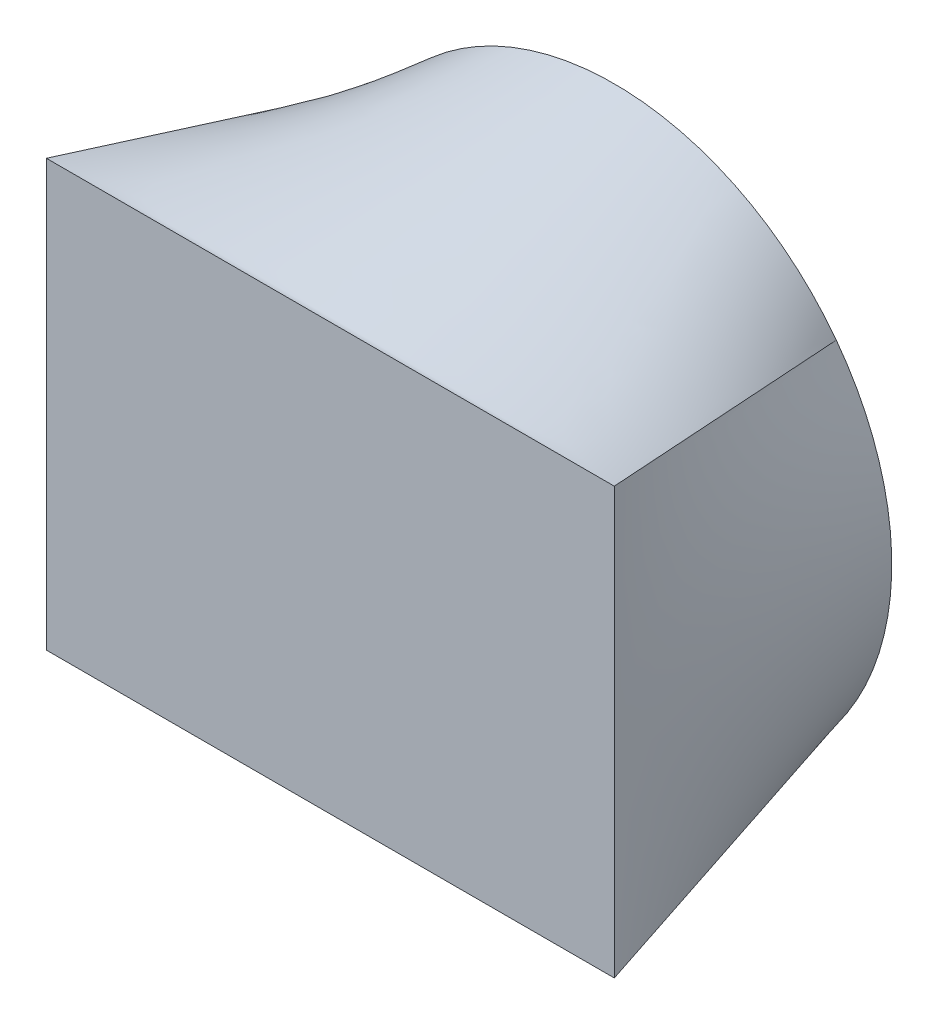
ISO-10303-21;
HEADER;
FILE_DESCRIPTION(('STEP AP214'),'2;1');
FILE_NAME('part.step','',(''),(''),'','','');
FILE_SCHEMA(('AUTOMOTIVE_DESIGN { 1 0 10303 214 1 1 1 1 }'));
ENDSEC;
DATA;
#1=APPLICATION_CONTEXT('core data for automotive mechanical design processes');
#2=APPLICATION_PROTOCOL_DEFINITION('international standard','automotive_design',2000,#1);
#3=PRODUCT_CONTEXT('',#1,'mechanical');
#4=PRODUCT('Part','Part','',(#3));
#5=PRODUCT_RELATED_PRODUCT_CATEGORY('part','',(#4));
#6=PRODUCT_DEFINITION_FORMATION('','',#4);
#7=PRODUCT_DEFINITION_CONTEXT('part definition',#1,'design');
#8=PRODUCT_DEFINITION('design','',#6,#7);
#9=PRODUCT_DEFINITION_SHAPE('','',#8);
#10=(LENGTH_UNIT() NAMED_UNIT(*) SI_UNIT(.MILLI.,.METRE.));
#11=(NAMED_UNIT(*) PLANE_ANGLE_UNIT() SI_UNIT($,.RADIAN.));
#12=(NAMED_UNIT(*) SI_UNIT($,.STERADIAN.) SOLID_ANGLE_UNIT());
#13=UNCERTAINTY_MEASURE_WITH_UNIT(LENGTH_MEASURE(1.E-05),#10,'distance_accuracy_value','');
#14=(GEOMETRIC_REPRESENTATION_CONTEXT(3) GLOBAL_UNCERTAINTY_ASSIGNED_CONTEXT((#13)) GLOBAL_UNIT_ASSIGNED_CONTEXT((#10,
#11,#12)) REPRESENTATION_CONTEXT('',''));
#15=CARTESIAN_POINT('',(0.,0.,0.));
#16=DIRECTION('',(0.,0.,1.));
#17=DIRECTION('',(1.,0.,0.));
#18=AXIS2_PLACEMENT_3D('',#15,#16,#17);
#19=CARTESIAN_POINT('',(50.,37.5,-50.));
#20=DIRECTION('',(0.,0.,1.));
#21=DIRECTION('',(1.,0.,0.));
#22=AXIS2_PLACEMENT_3D('',#19,#20,#21);
#23=PLANE('',#22);
#24=CARTESIAN_POINT('',(50.,37.5,-50.));
#25=DIRECTION('',(0.,0.,1.));
#26=DIRECTION('',(1.,0.,0.));
#27=AXIS2_PLACEMENT_3D('',#24,#25,#26);
#28=CIRCLE('',#27,48.860251190292);
#29=CARTESIAN_POINT('',(10.9117990477664,66.8161507141752,-50.));
#30=VERTEX_POINT('',#29);
#31=CARTESIAN_POINT('',(10.9117990477664,8.18384928582481,-50.));
#32=VERTEX_POINT('',#31);
#33=EDGE_CURVE('E100',#30,#32,#28,.T.);
#34=ORIENTED_EDGE('',*,*,#33,.F.);
#35=CARTESIAN_POINT('',(89.0882009522336,66.8161507141752,-50.));
#36=VERTEX_POINT('',#35);
#37=EDGE_CURVE('E155',#36,#30,#28,.T.);
#38=ORIENTED_EDGE('',*,*,#37,.F.);
#39=CARTESIAN_POINT('',(89.0882009522336,8.18384928582479,-50.));
#40=VERTEX_POINT('',#39);
#41=EDGE_CURVE('E128',#40,#36,#28,.T.);
#42=ORIENTED_EDGE('',*,*,#41,.F.);
#43=EDGE_CURVE('E110',#32,#40,#28,.T.);
#44=ORIENTED_EDGE('',*,*,#43,.F.);
#45=EDGE_LOOP('',(#34,#38,#42,#44));
#46=FACE_BOUND('',#45,.T.);
#47=ADVANCED_FACE('F61',(#46),#23,.F.);
#48=CARTESIAN_POINT('',(0.,75.,0.));
#49=DIRECTION('',(0.,0.,-1.));
#50=DIRECTION('',(-1.,0.,0.));
#51=AXIS2_PLACEMENT_3D('',#48,#49,#50);
#52=PLANE('',#51);
#53=DIRECTION('',(0.,-1.,0.));
#54=VECTOR('',#53,1.);
#55=CARTESIAN_POINT('',(0.,0.,0.));
#56=LINE('',#55,#54);
#57=CARTESIAN_POINT('',(0.,75.,0.));
#58=VERTEX_POINT('',#57);
#59=CARTESIAN_POINT('',(0.,0.,0.));
#60=VERTEX_POINT('',#59);
#61=EDGE_CURVE('E205',#58,#60,#56,.T.);
#62=ORIENTED_EDGE('',*,*,#61,.T.);
#63=DIRECTION('',(1.,0.,0.));
#64=VECTOR('',#63,1.);
#65=CARTESIAN_POINT('',(0.,0.,0.));
#66=LINE('',#65,#64);
#67=CARTESIAN_POINT('',(100.,0.,0.));
#68=VERTEX_POINT('',#67);
#69=EDGE_CURVE('E12',#60,#68,#66,.T.);
#70=ORIENTED_EDGE('',*,*,#69,.T.);
#71=DIRECTION('',(0.,1.,0.));
#72=VECTOR('',#71,1.);
#73=CARTESIAN_POINT('',(100.,0.,0.));
#74=LINE('',#73,#72);
#75=CARTESIAN_POINT('',(100.,75.,0.));
#76=VERTEX_POINT('',#75);
#77=EDGE_CURVE('E72',#68,#76,#74,.T.);
#78=ORIENTED_EDGE('',*,*,#77,.T.);
#79=DIRECTION('',(-1.,0.,0.));
#80=VECTOR('',#79,1.);
#81=CARTESIAN_POINT('',(0.,75.,0.));
#82=LINE('',#81,#80);
#83=EDGE_CURVE('E81',#76,#58,#82,.T.);
#84=ORIENTED_EDGE('',*,*,#83,.T.);
#85=EDGE_LOOP('',(#62,#70,#78,#84));
#86=FACE_BOUND('',#85,.T.);
#87=ADVANCED_FACE('F170',(#86),#52,.F.);
#88=CARTESIAN_POINT('',(0.,0.,0.));
#89=CARTESIAN_POINT('',(10.9117990477664,8.18384928582481,-50.));
#90=CARTESIAN_POINT('',(0.,3.125,0.));
#91=CARTESIAN_POINT('',(9.44599151205763,10.1382593334365,-50.));
#92=CARTESIAN_POINT('',(0.,6.24999999999999,0.));
#93=CARTESIAN_POINT('',(8.0902651266661,12.2527191081306,-50.));
#94=CARTESIAN_POINT('',(0.,12.5,0.));
#95=CARTESIAN_POINT('',(5.6857621845833,16.7611621245358,-50.));
#96=CARTESIAN_POINT('',(0.,15.625,0.));
#97=CARTESIAN_POINT('',(4.63741470937828,19.155099260913,-50.));
#98=CARTESIAN_POINT('',(0.,21.875,0.));
#99=CARTESIAN_POINT('',(2.92427222790712,24.1517648318706,-50.));
#100=CARTESIAN_POINT('',(0.,25.,0.));
#101=CARTESIAN_POINT('',(2.25987442558057,26.754230606235,-50.));
#102=CARTESIAN_POINT('',(0.,31.25,0.));
#103=CARTESIAN_POINT('',(1.36749219218832,32.0713414135305,-50.));
#104=CARTESIAN_POINT('',(0.,34.375,0.));
#105=CARTESIAN_POINT('',(1.139748809708,34.7855416005394,-50.));
#106=CARTESIAN_POINT('',(0.,40.625,0.));
#107=CARTESIAN_POINT('',(1.139748809708,40.2144583994607,-50.));
#108=CARTESIAN_POINT('',(0.,43.75,0.));
#109=CARTESIAN_POINT('',(1.36749219218832,42.9286585864696,-50.));
#110=CARTESIAN_POINT('',(0.,50.,0.));
#111=CARTESIAN_POINT('',(2.25987442558057,48.2457693937651,-50.));
#112=CARTESIAN_POINT('',(0.,53.125,0.));
#113=CARTESIAN_POINT('',(2.92427222790713,50.8482351681295,-50.));
#114=CARTESIAN_POINT('',(0.,59.375,0.));
#115=CARTESIAN_POINT('',(4.63741470937829,55.844900739087,-50.));
#116=CARTESIAN_POINT('',(0.,62.5,0.));
#117=CARTESIAN_POINT('',(5.68576218458331,58.2388378754642,-50.));
#118=CARTESIAN_POINT('',(0.,68.75,0.));
#119=CARTESIAN_POINT('',(8.09026512666611,62.7472808918695,-50.));
#120=CARTESIAN_POINT('',(0.,71.875,0.));
#121=CARTESIAN_POINT('',(9.44599151205764,64.8617406665635,-50.));
#122=CARTESIAN_POINT('',(0.,75.,0.));
#123=CARTESIAN_POINT('',(10.9117990477664,66.8161507141752,-50.));
#124=B_SPLINE_SURFACE_WITH_KNOTS('',3,1,((#88,#89),(#90,#91),(#92,#93),(#94,#95),(#96,#97),(#98,
#99),(#100,#101),(#102,#103),(#104,#105),(#106,#107),(#108,#109),(#110,#111),(#112,#113),(#114,
#115),(#116,#117),(#118,#119),(#120,#121),(#122,#123)),.UNSPECIFIED.,.F.,.F.,.F.,(4,2,2,2,2,2,2,
2,4),(2,2),(0.,0.125,0.25,0.375,0.5,0.625,0.75,0.875,1.),(0.,1.),.UNSPECIFIED.);
#125=DIRECTION('',(0.210542560059835,-0.157906920044876,-0.964747238920844));
#126=VECTOR('',#125,1.);
#127=CARTESIAN_POINT('',(5.4558995238832,70.9080753570876,-25.));
#128=LINE('',#127,#126);
#129=EDGE_CURVE('E115',#58,#30,#128,.T.);
#130=DIRECTION('',(-0.210542560059834,-0.157906920044876,0.964747238920844));
#131=VECTOR('',#130,1.);
#132=CARTESIAN_POINT('',(5.4558995238832,4.0919246429124,-25.));
#133=LINE('',#132,#131);
#134=EDGE_CURVE('E107',#32,#60,#133,.T.);
#135=ORIENTED_EDGE('',*,*,#61,.F.);
#136=ORIENTED_EDGE('',*,*,#129,.T.);
#137=ORIENTED_EDGE('',*,*,#33,.T.);
#138=ORIENTED_EDGE('',*,*,#134,.T.);
#139=EDGE_LOOP('',(#135,#136,#137,#138));
#140=FACE_BOUND('',#139,.T.);
#141=ADVANCED_FACE('F120',(#140),#124,.T.);
#142=CARTESIAN_POINT('',(0.,75.,0.));
#143=CARTESIAN_POINT('',(10.9117990477664,66.8161507141752,-50.));
#144=CARTESIAN_POINT('',(4.16666666666667,75.,0.));
#145=CARTESIAN_POINT('',(12.8662090953781,69.4220307776574,-50.));
#146=CARTESIAN_POINT('',(8.33333333333334,75.,0.));
#147=CARTESIAN_POINT('',(15.1832125126786,71.9653188636344,-50.));
#148=CARTESIAN_POINT('',(14.5833333333334,75.,0.));
#149=CARTESIAN_POINT('',(19.2174610628247,75.4861175983074,-50.));
#150=CARTESIAN_POINT('',(16.6666666666667,75.,0.));
#151=CARTESIAN_POINT('',(20.6545186554323,76.6101886118667,-50.));
#152=CARTESIAN_POINT('',(20.8333333333334,75.,0.));
#153=CARTESIAN_POINT('',(23.7039141527761,78.7223240212823,-50.));
#154=CARTESIAN_POINT('',(22.9166666666667,75.,0.));
#155=CARTESIAN_POINT('',(25.3162744851812,79.7102977410942,-50.));
#156=CARTESIAN_POINT('',(27.0833333333334,75.,0.));
#157=CARTESIAN_POINT('',(28.6976067474852,81.5136749476564,-50.));
#158=CARTESIAN_POINT('',(29.1666666666667,75.,0.));
#159=CARTESIAN_POINT('',(30.4665679541894,82.3289760689456,-50.));
#160=CARTESIAN_POINT('',(33.3333333333334,75.,0.));
#161=CARTESIAN_POINT('',(34.1327972211462,83.7539072820138,-50.));
#162=CARTESIAN_POINT('',(35.4166666666667,75.,0.));
#163=CARTESIAN_POINT('',(36.0300157543496,84.3634377688663,-50.));
#164=CARTESIAN_POINT('',(39.5833333333334,75.,0.));
#165=CARTESIAN_POINT('',(39.9157067365835,85.3502799230844,-50.));
#166=CARTESIAN_POINT('',(41.6666666666667,75.,0.));
#167=CARTESIAN_POINT('',(41.9040925823774,85.7275118374162,-50.));
#168=CARTESIAN_POINT('',(45.8333333333334,75.,0.));
#169=CARTESIAN_POINT('',(45.9283740472775,86.2325197075213,-50.));
#170=CARTESIAN_POINT('',(47.9166666666667,75.,0.));
#171=CARTESIAN_POINT('',(47.9641562004045,86.360251190292,-50.));
#172=CARTESIAN_POINT('',(52.0833333333333,75.,0.));
#173=CARTESIAN_POINT('',(52.0358437995955,86.360251190292,-50.));
#174=CARTESIAN_POINT('',(54.1666666666667,75.,0.));
#175=CARTESIAN_POINT('',(54.0716259527225,86.2325197075213,-50.));
#176=CARTESIAN_POINT('',(58.3333333333334,75.,0.));
#177=CARTESIAN_POINT('',(58.0959074176226,85.7275118374162,-50.));
#178=CARTESIAN_POINT('',(60.4166666666667,75.,0.));
#179=CARTESIAN_POINT('',(60.0842932634165,85.3502799230844,-50.));
#180=CARTESIAN_POINT('',(64.5833333333334,75.,0.));
#181=CARTESIAN_POINT('',(63.9699842456504,84.3634377688662,-50.));
#182=CARTESIAN_POINT('',(66.6666666666667,75.,0.));
#183=CARTESIAN_POINT('',(65.8672027788537,83.7539072820138,-50.));
#184=CARTESIAN_POINT('',(70.8333333333334,75.,0.));
#185=CARTESIAN_POINT('',(69.5334320458106,82.3289760689456,-50.));
#186=CARTESIAN_POINT('',(72.9166666666667,75.,0.));
#187=CARTESIAN_POINT('',(71.3023932525149,81.5136749476564,-50.));
#188=CARTESIAN_POINT('',(77.0833333333334,75.,0.));
#189=CARTESIAN_POINT('',(74.6837255148188,79.7102977410943,-50.));
#190=CARTESIAN_POINT('',(79.1666666666667,75.,0.));
#191=CARTESIAN_POINT('',(76.296085847224,78.7223240212823,-50.));
#192=CARTESIAN_POINT('',(83.3333333333333,75.,0.));
#193=CARTESIAN_POINT('',(79.3454813445677,76.6101886118668,-50.));
#194=CARTESIAN_POINT('',(85.4166666666667,75.,0.));
#195=CARTESIAN_POINT('',(80.7825389371753,75.4861175983074,-50.));
#196=CARTESIAN_POINT('',(91.6666666666666,75.,0.));
#197=CARTESIAN_POINT('',(84.8167874873214,71.9653188636344,-50.));
#198=CARTESIAN_POINT('',(95.8333333333333,75.,0.));
#199=CARTESIAN_POINT('',(87.1337909046219,69.4220307776575,-50.));
#200=CARTESIAN_POINT('',(100.,75.,0.));
#201=CARTESIAN_POINT('',(89.0882009522336,66.8161507141752,-50.));
#202=B_SPLINE_SURFACE_WITH_KNOTS('',3,1,((#142,#143),(#144,#145),(#146,#147),(#148,#149),(#150,
#151),(#152,#153),(#154,#155),(#156,#157),(#158,#159),(#160,#161),(#162,#163),(#164,#165),(#166,
#167),(#168,#169),(#170,#171),(#172,#173),(#174,#175),(#176,#177),(#178,#179),(#180,#181),(#182,
#183),(#184,#185),(#186,#187),(#188,#189),(#190,#191),(#192,#193),(#194,#195),(#196,#197),(#198,
#199),(#200,#201)),.UNSPECIFIED.,.F.,.F.,.F.,(4,2,2,2,2,2,2,2,2,2,2,2,2,2,4),(2,2),(0.,0.125,
0.1875,0.250000000000001,0.312500000000001,0.375000000000001,0.437500000000001,0.5,
0.562500000000001,0.625000000000001,0.687500000000001,0.75,0.8125,0.875,1.),(0.,1.),.UNSPECIFIED.);
#203=DIRECTION('',(-0.210542560059835,-0.157906920044876,-0.964747238920844));
#204=VECTOR('',#203,1.);
#205=CARTESIAN_POINT('',(94.5441004761168,70.9080753570876,-25.));
#206=LINE('',#205,#204);
#207=EDGE_CURVE('E116',#76,#36,#206,.T.);
#208=ORIENTED_EDGE('',*,*,#83,.F.);
#209=ORIENTED_EDGE('',*,*,#207,.T.);
#210=ORIENTED_EDGE('',*,*,#37,.T.);
#211=ORIENTED_EDGE('',*,*,#129,.F.);
#212=EDGE_LOOP('',(#208,#209,#210,#211));
#213=FACE_BOUND('',#212,.T.);
#214=ADVANCED_FACE('F215',(#213),#202,.T.);
#215=CARTESIAN_POINT('',(100.,0.,0.));
#216=CARTESIAN_POINT('',(89.0882009522336,8.18384928582479,-50.));
#217=CARTESIAN_POINT('',(95.8333333333333,0.,0.));
#218=CARTESIAN_POINT('',(87.1337909046219,5.57796922234256,-50.));
#219=CARTESIAN_POINT('',(91.6666666666667,0.,0.));
#220=CARTESIAN_POINT('',(84.8167874873213,3.03468113636561,-50.));
#221=CARTESIAN_POINT('',(85.4166666666667,0.,0.));
#222=CARTESIAN_POINT('',(80.7825389371753,-0.486117598307331,-50.));
#223=CARTESIAN_POINT('',(83.3333333333333,0.,0.));
#224=CARTESIAN_POINT('',(79.3454813445677,-1.61018861186678,-50.));
#225=CARTESIAN_POINT('',(79.1666666666667,0.,0.));
#226=CARTESIAN_POINT('',(76.2960858472239,-3.72232402128235,-50.));
#227=CARTESIAN_POINT('',(77.0833333333334,0.,0.));
#228=CARTESIAN_POINT('',(74.6837255148188,-4.71029774109424,-50.));
#229=CARTESIAN_POINT('',(72.9166666666667,0.,0.));
#230=CARTESIAN_POINT('',(71.3023932525149,-6.51367494765635,-50.));
#231=CARTESIAN_POINT('',(70.8333333333334,0.,0.));
#232=CARTESIAN_POINT('',(69.5334320458106,-7.32897606894559,-50.));
#233=CARTESIAN_POINT('',(66.6666666666667,0.,0.));
#234=CARTESIAN_POINT('',(65.8672027788538,-8.75390728201384,-50.));
#235=CARTESIAN_POINT('',(64.5833333333334,0.,0.));
#236=CARTESIAN_POINT('',(63.9699842456504,-9.36343776886626,-50.));
#237=CARTESIAN_POINT('',(60.4166666666667,0.,0.));
#238=CARTESIAN_POINT('',(60.0842932634165,-10.3502799230844,-50.));
#239=CARTESIAN_POINT('',(58.3333333333334,0.,0.));
#240=CARTESIAN_POINT('',(58.0959074176226,-10.7275118374162,-50.));
#241=CARTESIAN_POINT('',(54.1666666666667,0.,0.));
#242=CARTESIAN_POINT('',(54.0716259527225,-11.2325197075213,-50.));
#243=CARTESIAN_POINT('',(52.0833333333334,0.,0.));
#244=CARTESIAN_POINT('',(52.0358437995955,-11.360251190292,-50.));
#245=CARTESIAN_POINT('',(47.9166666666667,0.,0.));
#246=CARTESIAN_POINT('',(47.9641562004045,-11.360251190292,-50.));
#247=CARTESIAN_POINT('',(45.8333333333334,0.,0.));
#248=CARTESIAN_POINT('',(45.9283740472775,-11.2325197075213,-50.));
#249=CARTESIAN_POINT('',(41.6666666666667,0.,0.));
#250=CARTESIAN_POINT('',(41.9040925823774,-10.7275118374162,-50.));
#251=CARTESIAN_POINT('',(39.5833333333334,0.,0.));
#252=CARTESIAN_POINT('',(39.9157067365835,-10.3502799230844,-50.));
#253=CARTESIAN_POINT('',(35.4166666666667,0.,0.));
#254=CARTESIAN_POINT('',(36.0300157543496,-9.36343776886626,-50.));
#255=CARTESIAN_POINT('',(33.3333333333334,0.,0.));
#256=CARTESIAN_POINT('',(34.1327972211462,-8.75390728201383,-50.));
#257=CARTESIAN_POINT('',(29.1666666666667,0.,0.));
#258=CARTESIAN_POINT('',(30.4665679541894,-7.32897606894559,-50.));
#259=CARTESIAN_POINT('',(27.0833333333334,0.,0.));
#260=CARTESIAN_POINT('',(28.6976067474851,-6.51367494765634,-50.));
#261=CARTESIAN_POINT('',(22.9166666666667,0.,0.));
#262=CARTESIAN_POINT('',(25.3162744851812,-4.71029774109424,-50.));
#263=CARTESIAN_POINT('',(20.8333333333334,0.,0.));
#264=CARTESIAN_POINT('',(23.7039141527761,-3.72232402128234,-50.));
#265=CARTESIAN_POINT('',(16.6666666666667,0.,0.));
#266=CARTESIAN_POINT('',(20.6545186554323,-1.61018861186677,-50.));
#267=CARTESIAN_POINT('',(14.5833333333334,0.,0.));
#268=CARTESIAN_POINT('',(19.2174610628247,-0.486117598307323,-50.));
#269=CARTESIAN_POINT('',(8.33333333333335,0.,0.));
#270=CARTESIAN_POINT('',(15.1832125126786,3.03468113636562,-50.));
#271=CARTESIAN_POINT('',(4.16666666666667,0.,0.));
#272=CARTESIAN_POINT('',(12.8662090953781,5.57796922234256,-50.));
#273=CARTESIAN_POINT('',(0.,0.,0.));
#274=CARTESIAN_POINT('',(10.9117990477664,8.18384928582481,-50.));
#275=B_SPLINE_SURFACE_WITH_KNOTS('',3,1,((#215,#216),(#217,#218),(#219,#220),(#221,#222),(#223,
#224),(#225,#226),(#227,#228),(#229,#230),(#231,#232),(#233,#234),(#235,#236),(#237,#238),(#239,
#240),(#241,#242),(#243,#244),(#245,#246),(#247,#248),(#249,#250),(#251,#252),(#253,#254),(#255,
#256),(#257,#258),(#259,#260),(#261,#262),(#263,#264),(#265,#266),(#267,#268),(#269,#270),(#271,
#272),(#273,#274)),.UNSPECIFIED.,.F.,.F.,.F.,(4,2,2,2,2,2,2,2,2,2,2,2,2,2,4),(2,2),(0.,0.125,
0.1875,0.25,0.312500000000001,0.375000000000001,0.437500000000001,0.5,0.562500000000001,0.625,
0.6875,0.75,0.8125,0.875,1.),(0.,1.),.UNSPECIFIED.);
#276=DIRECTION('',(-0.210542560059835,0.157906920044876,-0.964747238920844));
#277=VECTOR('',#276,1.);
#278=CARTESIAN_POINT('',(94.5441004761168,4.0919246429124,-25.));
#279=LINE('',#278,#277);
#280=EDGE_CURVE('E122',#68,#40,#279,.T.);
#281=ORIENTED_EDGE('',*,*,#69,.F.);
#282=ORIENTED_EDGE('',*,*,#134,.F.);
#283=ORIENTED_EDGE('',*,*,#43,.T.);
#284=ORIENTED_EDGE('',*,*,#280,.F.);
#285=EDGE_LOOP('',(#281,#282,#283,#284));
#286=FACE_BOUND('',#285,.T.);
#287=ADVANCED_FACE('F108',(#286),#275,.T.);
#288=CARTESIAN_POINT('',(100.,75.,0.));
#289=CARTESIAN_POINT('',(89.0882009522336,66.8161507141752,-50.));
#290=CARTESIAN_POINT('',(100.,71.875,0.));
#291=CARTESIAN_POINT('',(90.5540084879424,64.8617406665635,-50.));
#292=CARTESIAN_POINT('',(100.,68.75,0.));
#293=CARTESIAN_POINT('',(91.9097348733339,62.7472808918695,-50.));
#294=CARTESIAN_POINT('',(100.,62.5,0.));
#295=CARTESIAN_POINT('',(94.3142378154167,58.2388378754642,-50.));
#296=CARTESIAN_POINT('',(100.,59.375,0.));
#297=CARTESIAN_POINT('',(95.3625852906217,55.844900739087,-50.));
#298=CARTESIAN_POINT('',(100.,53.125,0.));
#299=CARTESIAN_POINT('',(97.0757277720929,50.8482351681294,-50.));
#300=CARTESIAN_POINT('',(100.,50.,0.));
#301=CARTESIAN_POINT('',(97.7401255744194,48.2457693937651,-50.));
#302=CARTESIAN_POINT('',(100.,43.75,0.));
#303=CARTESIAN_POINT('',(98.6325078078117,42.9286585864695,-50.));
#304=CARTESIAN_POINT('',(100.,40.625,0.));
#305=CARTESIAN_POINT('',(98.860251190292,40.2144583994607,-50.));
#306=CARTESIAN_POINT('',(100.,34.375,0.));
#307=CARTESIAN_POINT('',(98.860251190292,34.7855416005393,-50.));
#308=CARTESIAN_POINT('',(100.,31.25,0.));
#309=CARTESIAN_POINT('',(98.6325078078117,32.0713414135305,-50.));
#310=CARTESIAN_POINT('',(100.,25.,0.));
#311=CARTESIAN_POINT('',(97.7401255744194,26.7542306062349,-50.));
#312=CARTESIAN_POINT('',(100.,21.875,0.));
#313=CARTESIAN_POINT('',(97.0757277720928,24.1517648318705,-50.));
#314=CARTESIAN_POINT('',(100.,15.625,0.));
#315=CARTESIAN_POINT('',(95.3625852906217,19.155099260913,-50.));
#316=CARTESIAN_POINT('',(100.,12.5,0.));
#317=CARTESIAN_POINT('',(94.3142378154167,16.7611621245358,-50.));
#318=CARTESIAN_POINT('',(100.,6.25,0.));
#319=CARTESIAN_POINT('',(91.9097348733339,12.2527191081305,-50.));
#320=CARTESIAN_POINT('',(100.,3.125,0.));
#321=CARTESIAN_POINT('',(90.5540084879424,10.1382593334365,-50.));
#322=CARTESIAN_POINT('',(100.,0.,0.));
#323=CARTESIAN_POINT('',(89.0882009522336,8.18384928582479,-50.));
#324=B_SPLINE_SURFACE_WITH_KNOTS('',3,1,((#288,#289),(#290,#291),(#292,#293),(#294,#295),(#296,
#297),(#298,#299),(#300,#301),(#302,#303),(#304,#305),(#306,#307),(#308,#309),(#310,#311),(#312,
#313),(#314,#315),(#316,#317),(#318,#319),(#320,#321),(#322,#323)),.UNSPECIFIED.,.F.,.F.,.F.,(4,
2,2,2,2,2,2,2,4),(2,2),(0.,0.125,0.25,0.375,0.5,0.625,0.75,0.875,1.),(0.,1.),.UNSPECIFIED.);
#325=ORIENTED_EDGE('',*,*,#77,.F.);
#326=ORIENTED_EDGE('',*,*,#280,.T.);
#327=ORIENTED_EDGE('',*,*,#41,.T.);
#328=ORIENTED_EDGE('',*,*,#207,.F.);
#329=EDGE_LOOP('',(#325,#326,#327,#328));
#330=FACE_BOUND('',#329,.T.);
#331=ADVANCED_FACE('F179',(#330),#324,.T.);
#332=CLOSED_SHELL('',(#47,#87,#141,#214,#287,#331));
#333=MANIFOLD_SOLID_BREP('B2',#332);
#334=ADVANCED_BREP_SHAPE_REPRESENTATION('',(#18,#333),#14);
#335=SHAPE_DEFINITION_REPRESENTATION(#9,#334);
ENDSEC;
END-ISO-10303-21;
